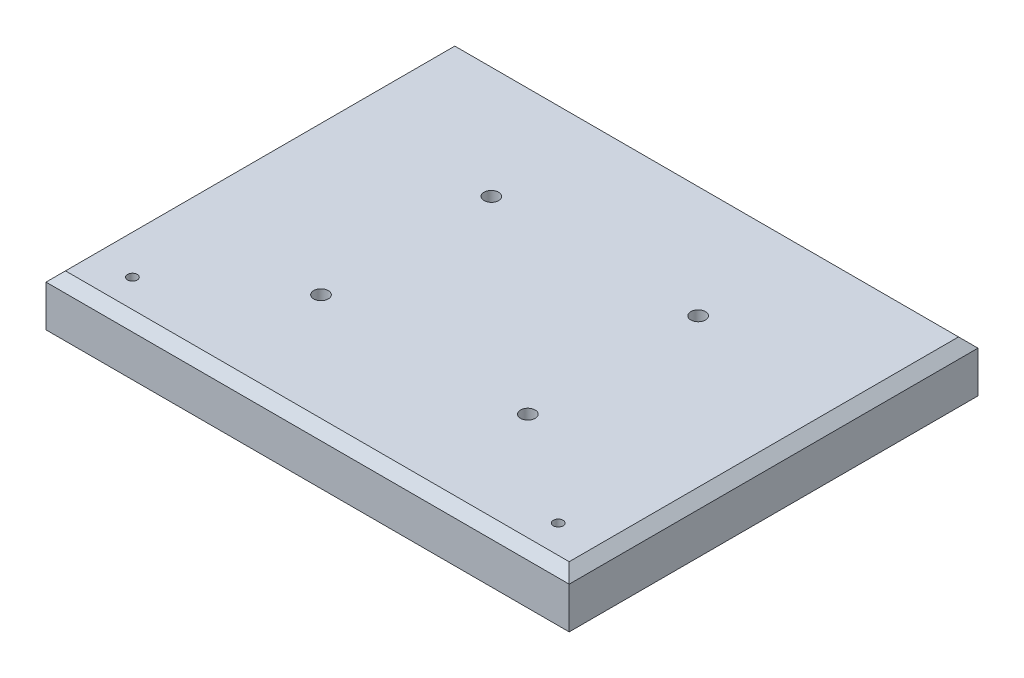
ISO-10303-21;
HEADER;
FILE_DESCRIPTION(('STEP AP214'),'2;1');
FILE_NAME('part.step','',(''),(''),'','','');
FILE_SCHEMA(('AUTOMOTIVE_DESIGN { 1 0 10303 214 1 1 1 1 }'));
ENDSEC;
DATA;
#1=APPLICATION_CONTEXT('core data for automotive mechanical design processes');
#2=APPLICATION_PROTOCOL_DEFINITION('international standard','automotive_design',2000,#1);
#3=PRODUCT_CONTEXT('',#1,'mechanical');
#4=PRODUCT('Part','Part','',(#3));
#5=PRODUCT_RELATED_PRODUCT_CATEGORY('part','',(#4));
#6=PRODUCT_DEFINITION_FORMATION('','',#4);
#7=PRODUCT_DEFINITION_CONTEXT('part definition',#1,'design');
#8=PRODUCT_DEFINITION('design','',#6,#7);
#9=PRODUCT_DEFINITION_SHAPE('','',#8);
#10=(LENGTH_UNIT() NAMED_UNIT(*) SI_UNIT(.MILLI.,.METRE.));
#11=(NAMED_UNIT(*) PLANE_ANGLE_UNIT() SI_UNIT($,.RADIAN.));
#12=(NAMED_UNIT(*) SI_UNIT($,.STERADIAN.) SOLID_ANGLE_UNIT());
#13=UNCERTAINTY_MEASURE_WITH_UNIT(LENGTH_MEASURE(1.E-05),#10,'distance_accuracy_value','');
#14=(GEOMETRIC_REPRESENTATION_CONTEXT(3) GLOBAL_UNCERTAINTY_ASSIGNED_CONTEXT((#13)) GLOBAL_UNIT_ASSIGNED_CONTEXT((#10,
#11,#12)) REPRESENTATION_CONTEXT('',''));
#15=CARTESIAN_POINT('',(0.,0.,0.));
#16=DIRECTION('',(0.,0.,1.));
#17=DIRECTION('',(1.,0.,0.));
#18=AXIS2_PLACEMENT_3D('',#15,#16,#17);
#19=CARTESIAN_POINT('',(195.,21.,-15.5));
#20=DIRECTION('',(0.,-1.,0.));
#21=DIRECTION('',(0.,0.,-1.));
#22=AXIS2_PLACEMENT_3D('',#19,#20,#21);
#23=CYLINDRICAL_SURFACE('',#22,2.);
#24=CARTESIAN_POINT('',(195.,21.,-15.5));
#25=DIRECTION('',(0.,1.,0.));
#26=DIRECTION('',(0.,0.,1.));
#27=AXIS2_PLACEMENT_3D('',#24,#25,#26);
#28=CIRCLE('',#27,2.);
#29=CARTESIAN_POINT('',(195.,21.,-13.5));
#30=VERTEX_POINT('',#29);
#31=EDGE_CURVE('E258',#30,#30,#28,.T.);
#32=ORIENTED_EDGE('',*,*,#31,.T.);
#33=EDGE_LOOP('',(#32));
#34=FACE_BOUND('',#33,.T.);
#35=CARTESIAN_POINT('',(195.,6.5,-15.5));
#36=DIRECTION('',(0.,-1.,0.));
#37=DIRECTION('',(0.,0.,-1.));
#38=AXIS2_PLACEMENT_3D('',#35,#36,#37);
#39=CIRCLE('',#38,2.);
#40=CARTESIAN_POINT('',(195.,6.5,-17.5));
#41=VERTEX_POINT('',#40);
#42=EDGE_CURVE('E52',#41,#41,#39,.T.);
#43=ORIENTED_EDGE('',*,*,#42,.T.);
#44=EDGE_LOOP('',(#43));
#45=FACE_BOUND('',#44,.T.);
#46=ADVANCED_FACE('F47',(#34,#45),#23,.F.);
#47=CARTESIAN_POINT('',(20.,21.,-15.5));
#48=DIRECTION('',(0.,-1.,0.));
#49=DIRECTION('',(0.,0.,-1.));
#50=AXIS2_PLACEMENT_3D('',#47,#48,#49);
#51=CYLINDRICAL_SURFACE('',#50,2.);
#52=CARTESIAN_POINT('',(20.,21.,-15.5));
#53=DIRECTION('',(0.,1.,0.));
#54=DIRECTION('',(0.,0.,1.));
#55=AXIS2_PLACEMENT_3D('',#52,#53,#54);
#56=CIRCLE('',#55,2.);
#57=CARTESIAN_POINT('',(20.,21.,-13.5));
#58=VERTEX_POINT('',#57);
#59=EDGE_CURVE('E182',#58,#58,#56,.T.);
#60=ORIENTED_EDGE('',*,*,#59,.T.);
#61=EDGE_LOOP('',(#60));
#62=FACE_BOUND('',#61,.T.);
#63=CARTESIAN_POINT('',(20.,6.5,-15.5));
#64=DIRECTION('',(0.,-1.,0.));
#65=DIRECTION('',(0.,0.,-1.));
#66=AXIS2_PLACEMENT_3D('',#63,#64,#65);
#67=CIRCLE('',#66,2.);
#68=CARTESIAN_POINT('',(20.,6.5,-17.5));
#69=VERTEX_POINT('',#68);
#70=EDGE_CURVE('E198',#69,#69,#67,.T.);
#71=ORIENTED_EDGE('',*,*,#70,.T.);
#72=EDGE_LOOP('',(#71));
#73=FACE_BOUND('',#72,.T.);
#74=ADVANCED_FACE('F290',(#62,#73),#51,.F.);
#75=CARTESIAN_POINT('',(150.,21.,-118.));
#76=DIRECTION('',(0.,-1.,0.));
#77=DIRECTION('',(0.,0.,-1.));
#78=AXIS2_PLACEMENT_3D('',#75,#76,#77);
#79=CYLINDRICAL_SURFACE('',#78,2.99999999999999);
#80=CARTESIAN_POINT('',(150.,21.,-118.));
#81=DIRECTION('',(0.,1.,0.));
#82=DIRECTION('',(0.,0.,1.));
#83=AXIS2_PLACEMENT_3D('',#80,#81,#82);
#84=CIRCLE('',#83,2.99999999999999);
#85=CARTESIAN_POINT('',(150.,21.,-115.));
#86=VERTEX_POINT('',#85);
#87=EDGE_CURVE('E126',#86,#86,#84,.T.);
#88=ORIENTED_EDGE('',*,*,#87,.T.);
#89=EDGE_LOOP('',(#88));
#90=FACE_BOUND('',#89,.T.);
#91=CARTESIAN_POINT('',(150.,13.,-118.));
#92=DIRECTION('',(0.,-1.,0.));
#93=DIRECTION('',(0.,0.,-1.));
#94=AXIS2_PLACEMENT_3D('',#91,#92,#93);
#95=CIRCLE('',#94,2.99999999999999);
#96=CARTESIAN_POINT('',(150.,13.,-121.));
#97=VERTEX_POINT('',#96);
#98=EDGE_CURVE('E171',#97,#97,#95,.T.);
#99=ORIENTED_EDGE('',*,*,#98,.T.);
#100=EDGE_LOOP('',(#99));
#101=FACE_BOUND('',#100,.T.);
#102=ADVANCED_FACE('F292',(#90,#101),#79,.F.);
#103=CARTESIAN_POINT('',(65.,21.,-118.));
#104=DIRECTION('',(0.,-1.,0.));
#105=DIRECTION('',(0.,0.,-1.));
#106=AXIS2_PLACEMENT_3D('',#103,#104,#105);
#107=CYLINDRICAL_SURFACE('',#106,3.00000000000001);
#108=CARTESIAN_POINT('',(65.,21.,-118.));
#109=DIRECTION('',(0.,1.,0.));
#110=DIRECTION('',(0.,0.,1.));
#111=AXIS2_PLACEMENT_3D('',#108,#109,#110);
#112=CIRCLE('',#111,3.00000000000001);
#113=CARTESIAN_POINT('',(65.,21.,-115.));
#114=VERTEX_POINT('',#113);
#115=EDGE_CURVE('E130',#114,#114,#112,.T.);
#116=ORIENTED_EDGE('',*,*,#115,.T.);
#117=EDGE_LOOP('',(#116));
#118=FACE_BOUND('',#117,.T.);
#119=CARTESIAN_POINT('',(65.,13.,-118.));
#120=DIRECTION('',(0.,-1.,0.));
#121=DIRECTION('',(0.,0.,-1.));
#122=AXIS2_PLACEMENT_3D('',#119,#120,#121);
#123=CIRCLE('',#122,3.00000000000001);
#124=CARTESIAN_POINT('',(65.,13.,-121.));
#125=VERTEX_POINT('',#124);
#126=EDGE_CURVE('E192',#125,#125,#123,.T.);
#127=ORIENTED_EDGE('',*,*,#126,.T.);
#128=EDGE_LOOP('',(#127));
#129=FACE_BOUND('',#128,.T.);
#130=ADVANCED_FACE('F273',(#118,#129),#107,.F.);
#131=CARTESIAN_POINT('',(65.,21.,-48.));
#132=DIRECTION('',(0.,-1.,0.));
#133=DIRECTION('',(0.,0.,-1.));
#134=AXIS2_PLACEMENT_3D('',#131,#132,#133);
#135=CYLINDRICAL_SURFACE('',#134,3.00000000000001);
#136=CARTESIAN_POINT('',(65.,21.,-48.));
#137=DIRECTION('',(0.,1.,0.));
#138=DIRECTION('',(0.,0.,1.));
#139=AXIS2_PLACEMENT_3D('',#136,#137,#138);
#140=CIRCLE('',#139,3.00000000000001);
#141=CARTESIAN_POINT('',(65.,21.,-45.));
#142=VERTEX_POINT('',#141);
#143=EDGE_CURVE('E266',#142,#142,#140,.T.);
#144=ORIENTED_EDGE('',*,*,#143,.T.);
#145=EDGE_LOOP('',(#144));
#146=FACE_BOUND('',#145,.T.);
#147=CARTESIAN_POINT('',(65.,13.,-48.));
#148=DIRECTION('',(0.,-1.,0.));
#149=DIRECTION('',(0.,0.,-1.));
#150=AXIS2_PLACEMENT_3D('',#147,#148,#149);
#151=CIRCLE('',#150,3.00000000000001);
#152=CARTESIAN_POINT('',(65.,13.,-51.));
#153=VERTEX_POINT('',#152);
#154=EDGE_CURVE('E187',#153,#153,#151,.T.);
#155=ORIENTED_EDGE('',*,*,#154,.T.);
#156=EDGE_LOOP('',(#155));
#157=FACE_BOUND('',#156,.T.);
#158=ADVANCED_FACE('F309',(#146,#157),#135,.F.);
#159=CARTESIAN_POINT('',(150.,21.,-48.));
#160=DIRECTION('',(0.,-1.,0.));
#161=DIRECTION('',(0.,0.,-1.));
#162=AXIS2_PLACEMENT_3D('',#159,#160,#161);
#163=CYLINDRICAL_SURFACE('',#162,2.99999999999999);
#164=CARTESIAN_POINT('',(150.,21.,-48.));
#165=DIRECTION('',(0.,1.,0.));
#166=DIRECTION('',(0.,0.,1.));
#167=AXIS2_PLACEMENT_3D('',#164,#165,#166);
#168=CIRCLE('',#167,2.99999999999999);
#169=CARTESIAN_POINT('',(150.,21.,-45.));
#170=VERTEX_POINT('',#169);
#171=EDGE_CURVE('E262',#170,#170,#168,.T.);
#172=ORIENTED_EDGE('',*,*,#171,.T.);
#173=EDGE_LOOP('',(#172));
#174=FACE_BOUND('',#173,.T.);
#175=CARTESIAN_POINT('',(150.,13.,-48.));
#176=DIRECTION('',(0.,-1.,0.));
#177=DIRECTION('',(0.,0.,-1.));
#178=AXIS2_PLACEMENT_3D('',#175,#176,#177);
#179=CIRCLE('',#178,2.99999999999999);
#180=CARTESIAN_POINT('',(150.,13.,-51.));
#181=VERTEX_POINT('',#180);
#182=EDGE_CURVE('E183',#181,#181,#179,.T.);
#183=ORIENTED_EDGE('',*,*,#182,.T.);
#184=EDGE_LOOP('',(#183));
#185=FACE_BOUND('',#184,.T.);
#186=ADVANCED_FACE('F279',(#174,#185),#163,.F.);
#187=CARTESIAN_POINT('',(0.,21.,0.));
#188=DIRECTION('',(0.,-1.,0.));
#189=DIRECTION('',(0.,0.,-1.));
#190=AXIS2_PLACEMENT_3D('',#187,#188,#189);
#191=PLANE('',#190);
#192=DIRECTION('',(0.,0.,-1.));
#193=VECTOR('',#192,1.);
#194=CARTESIAN_POINT('',(211.,21.,0.));
#195=LINE('',#194,#193);
#196=CARTESIAN_POINT('',(211.,21.,-4.));
#197=VERTEX_POINT('',#196);
#198=CARTESIAN_POINT('',(211.,21.,-164.));
#199=VERTEX_POINT('',#198);
#200=EDGE_CURVE('E109',#197,#199,#195,.T.);
#201=ORIENTED_EDGE('',*,*,#200,.T.);
#202=DIRECTION('',(-1.,0.,0.));
#203=VECTOR('',#202,1.);
#204=CARTESIAN_POINT('',(0.,21.,-164.));
#205=LINE('',#204,#203);
#206=CARTESIAN_POINT('',(4.,21.,-164.));
#207=VERTEX_POINT('',#206);
#208=EDGE_CURVE('E154',#199,#207,#205,.T.);
#209=ORIENTED_EDGE('',*,*,#208,.T.);
#210=DIRECTION('',(0.,0.,1.));
#211=VECTOR('',#210,1.);
#212=CARTESIAN_POINT('',(4.,21.,0.));
#213=LINE('',#212,#211);
#214=CARTESIAN_POINT('',(4.,21.,-4.));
#215=VERTEX_POINT('',#214);
#216=EDGE_CURVE('E151',#207,#215,#213,.T.);
#217=ORIENTED_EDGE('',*,*,#216,.T.);
#218=DIRECTION('',(1.,0.,0.));
#219=VECTOR('',#218,1.);
#220=CARTESIAN_POINT('',(0.,21.,-4.));
#221=LINE('',#220,#219);
#222=EDGE_CURVE('E148',#215,#197,#221,.T.);
#223=ORIENTED_EDGE('',*,*,#222,.T.);
#224=EDGE_LOOP('',(#201,#209,#217,#223));
#225=FACE_BOUND('',#224,.T.);
#226=ORIENTED_EDGE('',*,*,#87,.F.);
#227=EDGE_LOOP('',(#226));
#228=FACE_BOUND('',#227,.T.);
#229=ORIENTED_EDGE('',*,*,#115,.F.);
#230=EDGE_LOOP('',(#229));
#231=FACE_BOUND('',#230,.T.);
#232=ORIENTED_EDGE('',*,*,#143,.F.);
#233=EDGE_LOOP('',(#232));
#234=FACE_BOUND('',#233,.T.);
#235=ORIENTED_EDGE('',*,*,#171,.F.);
#236=EDGE_LOOP('',(#235));
#237=FACE_BOUND('',#236,.T.);
#238=ORIENTED_EDGE('',*,*,#31,.F.);
#239=EDGE_LOOP('',(#238));
#240=FACE_BOUND('',#239,.T.);
#241=ORIENTED_EDGE('',*,*,#59,.F.);
#242=EDGE_LOOP('',(#241));
#243=FACE_BOUND('',#242,.T.);
#244=ADVANCED_FACE('F276',(#225,#228,#231,#234,#237,#240,#243),#191,.F.);
#245=CARTESIAN_POINT('',(0.,0.,0.));
#246=DIRECTION('',(0.,-1.,0.));
#247=DIRECTION('',(0.,0.,-1.));
#248=AXIS2_PLACEMENT_3D('',#245,#246,#247);
#249=PLANE('',#248);
#250=CARTESIAN_POINT('',(20.,0.,-15.5));
#251=DIRECTION('',(0.,-1.,0.));
#252=DIRECTION('',(0.,0.,-1.));
#253=AXIS2_PLACEMENT_3D('',#250,#251,#252);
#254=CIRCLE('',#253,5.);
#255=CARTESIAN_POINT('',(20.,0.,-20.5));
#256=VERTEX_POINT('',#255);
#257=EDGE_CURVE('E209',#256,#256,#254,.T.);
#258=ORIENTED_EDGE('',*,*,#257,.F.);
#259=EDGE_LOOP('',(#258));
#260=FACE_BOUND('',#259,.T.);
#261=CARTESIAN_POINT('',(195.,0.,-15.5));
#262=DIRECTION('',(0.,-1.,0.));
#263=DIRECTION('',(0.,0.,-1.));
#264=AXIS2_PLACEMENT_3D('',#261,#262,#263);
#265=CIRCLE('',#264,5.00000000000002);
#266=CARTESIAN_POINT('',(195.,0.,-20.5));
#267=VERTEX_POINT('',#266);
#268=EDGE_CURVE('E215',#267,#267,#265,.T.);
#269=ORIENTED_EDGE('',*,*,#268,.F.);
#270=EDGE_LOOP('',(#269));
#271=FACE_BOUND('',#270,.T.);
#272=CARTESIAN_POINT('',(150.,0.,-48.));
#273=DIRECTION('',(0.,-1.,0.));
#274=DIRECTION('',(0.,0.,-1.));
#275=AXIS2_PLACEMENT_3D('',#272,#273,#274);
#276=CIRCLE('',#275,9.50000000000001);
#277=CARTESIAN_POINT('',(150.,0.,-57.5));
#278=VERTEX_POINT('',#277);
#279=EDGE_CURVE('E233',#278,#278,#276,.T.);
#280=ORIENTED_EDGE('',*,*,#279,.F.);
#281=EDGE_LOOP('',(#280));
#282=FACE_BOUND('',#281,.T.);
#283=CARTESIAN_POINT('',(65.,0.,-118.));
#284=DIRECTION('',(0.,-1.,0.));
#285=DIRECTION('',(0.,0.,-1.));
#286=AXIS2_PLACEMENT_3D('',#283,#284,#285);
#287=CIRCLE('',#286,9.49999999999999);
#288=CARTESIAN_POINT('',(65.,0.,-127.5));
#289=VERTEX_POINT('',#288);
#290=EDGE_CURVE('E242',#289,#289,#287,.T.);
#291=ORIENTED_EDGE('',*,*,#290,.F.);
#292=EDGE_LOOP('',(#291));
#293=FACE_BOUND('',#292,.T.);
#294=CARTESIAN_POINT('',(150.,0.,-118.));
#295=DIRECTION('',(0.,-1.,0.));
#296=DIRECTION('',(0.,0.,-1.));
#297=AXIS2_PLACEMENT_3D('',#294,#295,#296);
#298=CIRCLE('',#297,9.50000000000001);
#299=CARTESIAN_POINT('',(150.,0.,-127.5));
#300=VERTEX_POINT('',#299);
#301=EDGE_CURVE('E225',#300,#300,#298,.T.);
#302=ORIENTED_EDGE('',*,*,#301,.F.);
#303=EDGE_LOOP('',(#302));
#304=FACE_BOUND('',#303,.T.);
#305=CARTESIAN_POINT('',(65.,0.,-48.));
#306=DIRECTION('',(0.,-1.,0.));
#307=DIRECTION('',(0.,0.,-1.));
#308=AXIS2_PLACEMENT_3D('',#305,#306,#307);
#309=CIRCLE('',#308,9.5);
#310=CARTESIAN_POINT('',(65.,0.,-57.5));
#311=VERTEX_POINT('',#310);
#312=EDGE_CURVE('E237',#311,#311,#309,.T.);
#313=ORIENTED_EDGE('',*,*,#312,.F.);
#314=EDGE_LOOP('',(#313));
#315=FACE_BOUND('',#314,.T.);
#316=DIRECTION('',(0.,0.,1.));
#317=VECTOR('',#316,1.);
#318=CARTESIAN_POINT('',(0.,0.,0.));
#319=LINE('',#318,#317);
#320=CARTESIAN_POINT('',(0.,0.,-168.));
#321=VERTEX_POINT('',#320);
#322=CARTESIAN_POINT('',(0.,0.,0.));
#323=VERTEX_POINT('',#322);
#324=EDGE_CURVE('E116',#321,#323,#319,.T.);
#325=ORIENTED_EDGE('',*,*,#324,.F.);
#326=DIRECTION('',(-1.,0.,0.));
#327=VECTOR('',#326,1.);
#328=CARTESIAN_POINT('',(0.,0.,-168.));
#329=LINE('',#328,#327);
#330=CARTESIAN_POINT('',(215.,0.,-168.));
#331=VERTEX_POINT('',#330);
#332=EDGE_CURVE('E136',#331,#321,#329,.T.);
#333=ORIENTED_EDGE('',*,*,#332,.F.);
#334=DIRECTION('',(0.,0.,-1.));
#335=VECTOR('',#334,1.);
#336=CARTESIAN_POINT('',(215.,0.,0.));
#337=LINE('',#336,#335);
#338=CARTESIAN_POINT('',(215.,0.,0.));
#339=VERTEX_POINT('',#338);
#340=EDGE_CURVE('E118',#339,#331,#337,.T.);
#341=ORIENTED_EDGE('',*,*,#340,.F.);
#342=DIRECTION('',(1.,0.,0.));
#343=VECTOR('',#342,1.);
#344=CARTESIAN_POINT('',(0.,0.,0.));
#345=LINE('',#344,#343);
#346=EDGE_CURVE('E103',#323,#339,#345,.T.);
#347=ORIENTED_EDGE('',*,*,#346,.F.);
#348=EDGE_LOOP('',(#325,#333,#341,#347));
#349=FACE_BOUND('',#348,.T.);
#350=ADVANCED_FACE('F114',(#260,#271,#282,#293,#304,#315,#349),#249,.T.);
#351=CARTESIAN_POINT('',(0.,21.,0.));
#352=DIRECTION('',(1.,0.,0.));
#353=DIRECTION('',(0.,0.,-1.));
#354=AXIS2_PLACEMENT_3D('',#351,#352,#353);
#355=PLANE('',#354);
#356=DIRECTION('',(0.,-1.,0.));
#357=VECTOR('',#356,1.);
#358=CARTESIAN_POINT('',(0.,21.,0.));
#359=LINE('',#358,#357);
#360=CARTESIAN_POINT('',(0.,17.,0.));
#361=VERTEX_POINT('',#360);
#362=EDGE_CURVE('E100',#361,#323,#359,.T.);
#363=ORIENTED_EDGE('',*,*,#362,.F.);
#364=DIRECTION('',(0.,0.,-1.));
#365=VECTOR('',#364,1.);
#366=CARTESIAN_POINT('',(0.,17.,0.));
#367=LINE('',#366,#365);
#368=CARTESIAN_POINT('',(0.,17.,-168.));
#369=VERTEX_POINT('',#368);
#370=EDGE_CURVE('E162',#361,#369,#367,.T.);
#371=ORIENTED_EDGE('',*,*,#370,.T.);
#372=DIRECTION('',(0.,-1.,0.));
#373=VECTOR('',#372,1.);
#374=CARTESIAN_POINT('',(0.,21.,-168.));
#375=LINE('',#374,#373);
#376=EDGE_CURVE('E123',#369,#321,#375,.T.);
#377=ORIENTED_EDGE('',*,*,#376,.T.);
#378=ORIENTED_EDGE('',*,*,#324,.T.);
#379=EDGE_LOOP('',(#363,#371,#377,#378));
#380=FACE_BOUND('',#379,.T.);
#381=ADVANCED_FACE('F121',(#380),#355,.F.);
#382=CARTESIAN_POINT('',(0.,21.,0.));
#383=DIRECTION('',(0.,0.,-1.));
#384=DIRECTION('',(-1.,0.,0.));
#385=AXIS2_PLACEMENT_3D('',#382,#383,#384);
#386=PLANE('',#385);
#387=DIRECTION('',(0.,-1.,0.));
#388=VECTOR('',#387,1.);
#389=CARTESIAN_POINT('',(215.,21.,0.));
#390=LINE('',#389,#388);
#391=CARTESIAN_POINT('',(215.,17.,0.));
#392=VERTEX_POINT('',#391);
#393=EDGE_CURVE('E110',#392,#339,#390,.T.);
#394=ORIENTED_EDGE('',*,*,#393,.F.);
#395=DIRECTION('',(-1.,0.,0.));
#396=VECTOR('',#395,1.);
#397=CARTESIAN_POINT('',(0.,17.,0.));
#398=LINE('',#397,#396);
#399=EDGE_CURVE('E58',#392,#361,#398,.T.);
#400=ORIENTED_EDGE('',*,*,#399,.T.);
#401=ORIENTED_EDGE('',*,*,#362,.T.);
#402=ORIENTED_EDGE('',*,*,#346,.T.);
#403=EDGE_LOOP('',(#394,#400,#401,#402));
#404=FACE_BOUND('',#403,.T.);
#405=ADVANCED_FACE('F102',(#404),#386,.F.);
#406=CARTESIAN_POINT('',(215.,21.,0.));
#407=DIRECTION('',(-1.,0.,0.));
#408=DIRECTION('',(0.,0.,1.));
#409=AXIS2_PLACEMENT_3D('',#406,#407,#408);
#410=PLANE('',#409);
#411=DIRECTION('',(0.,-1.,0.));
#412=VECTOR('',#411,1.);
#413=CARTESIAN_POINT('',(215.,21.,-168.));
#414=LINE('',#413,#412);
#415=CARTESIAN_POINT('',(215.,17.,-168.));
#416=VERTEX_POINT('',#415);
#417=EDGE_CURVE('E141',#416,#331,#414,.T.);
#418=ORIENTED_EDGE('',*,*,#417,.F.);
#419=DIRECTION('',(0.,0.,1.));
#420=VECTOR('',#419,1.);
#421=CARTESIAN_POINT('',(215.,17.,0.));
#422=LINE('',#421,#420);
#423=EDGE_CURVE('E11',#416,#392,#422,.T.);
#424=ORIENTED_EDGE('',*,*,#423,.T.);
#425=ORIENTED_EDGE('',*,*,#393,.T.);
#426=ORIENTED_EDGE('',*,*,#340,.T.);
#427=EDGE_LOOP('',(#418,#424,#425,#426));
#428=FACE_BOUND('',#427,.T.);
#429=ADVANCED_FACE('F321',(#428),#410,.F.);
#430=CARTESIAN_POINT('',(0.,21.,-168.));
#431=DIRECTION('',(0.,0.,1.));
#432=DIRECTION('',(1.,0.,0.));
#433=AXIS2_PLACEMENT_3D('',#430,#431,#432);
#434=PLANE('',#433);
#435=ORIENTED_EDGE('',*,*,#376,.F.);
#436=DIRECTION('',(1.,0.,0.));
#437=VECTOR('',#436,1.);
#438=CARTESIAN_POINT('',(0.,17.,-168.));
#439=LINE('',#438,#437);
#440=EDGE_CURVE('E158',#369,#416,#439,.T.);
#441=ORIENTED_EDGE('',*,*,#440,.T.);
#442=ORIENTED_EDGE('',*,*,#417,.T.);
#443=ORIENTED_EDGE('',*,*,#332,.T.);
#444=EDGE_LOOP('',(#435,#441,#442,#443));
#445=FACE_BOUND('',#444,.T.);
#446=ADVANCED_FACE('F318',(#445),#434,.F.);
#447=CARTESIAN_POINT('',(0.,21.,-4.));
#448=DIRECTION('',(0.,-0.707106781186545,-0.70710678118655));
#449=DIRECTION('',(1.,0.,0.));
#450=AXIS2_PLACEMENT_3D('',#447,#448,#449);
#451=PLANE('',#450);
#452=DIRECTION('',(-0.577350269189624,-0.577350269189628,0.577350269189624));
#453=VECTOR('',#452,1.);
#454=CARTESIAN_POINT('',(2.66666666666668,19.6666666666667,-2.66666666666667));
#455=LINE('',#454,#453);
#456=EDGE_CURVE('E174',#361,#215,#455,.F.);
#457=ORIENTED_EDGE('',*,*,#456,.F.);
#458=ORIENTED_EDGE('',*,*,#399,.F.);
#459=DIRECTION('',(0.577350269189624,-0.577350269189628,0.577350269189624));
#460=VECTOR('',#459,1.);
#461=CARTESIAN_POINT('',(212.333333333333,19.6666666666667,-2.66666666666668));
#462=LINE('',#461,#460);
#463=EDGE_CURVE('E178',#197,#392,#462,.T.);
#464=ORIENTED_EDGE('',*,*,#463,.F.);
#465=ORIENTED_EDGE('',*,*,#222,.F.);
#466=EDGE_LOOP('',(#457,#458,#464,#465));
#467=FACE_BOUND('',#466,.T.);
#468=ADVANCED_FACE('F50',(#467),#451,.F.);
#469=CARTESIAN_POINT('',(211.,21.,0.));
#470=DIRECTION('',(-0.70710678118655,-0.707106781186545,0.));
#471=DIRECTION('',(0.,0.,-1.));
#472=AXIS2_PLACEMENT_3D('',#469,#470,#471);
#473=PLANE('',#472);
#474=ORIENTED_EDGE('',*,*,#463,.T.);
#475=ORIENTED_EDGE('',*,*,#423,.F.);
#476=DIRECTION('',(-0.577350269189624,0.577350269189628,0.577350269189624));
#477=VECTOR('',#476,1.);
#478=CARTESIAN_POINT('',(156.333333333334,75.6666666666668,-109.333333333334));
#479=LINE('',#478,#477);
#480=EDGE_CURVE('E170',#199,#416,#479,.F.);
#481=ORIENTED_EDGE('',*,*,#480,.F.);
#482=ORIENTED_EDGE('',*,*,#200,.F.);
#483=EDGE_LOOP('',(#474,#475,#481,#482));
#484=FACE_BOUND('',#483,.T.);
#485=ADVANCED_FACE('F343',(#484),#473,.F.);
#486=CARTESIAN_POINT('',(4.,21.,0.));
#487=DIRECTION('',(0.70710678118655,-0.707106781186545,0.));
#488=DIRECTION('',(0.,0.,1.));
#489=AXIS2_PLACEMENT_3D('',#486,#487,#488);
#490=PLANE('',#489);
#491=ORIENTED_EDGE('',*,*,#456,.T.);
#492=ORIENTED_EDGE('',*,*,#216,.F.);
#493=DIRECTION('',(-0.577350269189624,-0.577350269189628,-0.577350269189624));
#494=VECTOR('',#493,1.);
#495=CARTESIAN_POINT('',(58.6666666666664,75.6666666666668,-109.333333333334));
#496=LINE('',#495,#494);
#497=EDGE_CURVE('E167',#369,#207,#496,.F.);
#498=ORIENTED_EDGE('',*,*,#497,.F.);
#499=ORIENTED_EDGE('',*,*,#370,.F.);
#500=EDGE_LOOP('',(#491,#492,#498,#499));
#501=FACE_BOUND('',#500,.T.);
#502=ADVANCED_FACE('F337',(#501),#490,.F.);
#503=CARTESIAN_POINT('',(0.,21.,-164.));
#504=DIRECTION('',(0.,-0.707106781186545,0.70710678118655));
#505=DIRECTION('',(-1.,0.,0.));
#506=AXIS2_PLACEMENT_3D('',#503,#504,#505);
#507=PLANE('',#506);
#508=ORIENTED_EDGE('',*,*,#480,.T.);
#509=ORIENTED_EDGE('',*,*,#440,.F.);
#510=ORIENTED_EDGE('',*,*,#497,.T.);
#511=ORIENTED_EDGE('',*,*,#208,.F.);
#512=EDGE_LOOP('',(#508,#509,#510,#511));
#513=FACE_BOUND('',#512,.T.);
#514=ADVANCED_FACE('F330',(#513),#507,.F.);
#515=CARTESIAN_POINT('',(150.,13.,-48.));
#516=DIRECTION('',(0.,-1.,0.));
#517=DIRECTION('',(0.,0.,-1.));
#518=AXIS2_PLACEMENT_3D('',#515,#516,#517);
#519=CYLINDRICAL_SURFACE('',#518,9.50000000000001);
#520=CARTESIAN_POINT('',(150.,13.,-48.));
#521=DIRECTION('',(0.,-1.,0.));
#522=DIRECTION('',(0.,0.,-1.));
#523=AXIS2_PLACEMENT_3D('',#520,#521,#522);
#524=CIRCLE('',#523,9.50000000000001);
#525=CARTESIAN_POINT('',(150.,13.,-57.5));
#526=VERTEX_POINT('',#525);
#527=EDGE_CURVE('E238',#526,#526,#524,.T.);
#528=ORIENTED_EDGE('',*,*,#527,.F.);
#529=EDGE_LOOP('',(#528));
#530=FACE_BOUND('',#529,.T.);
#531=ORIENTED_EDGE('',*,*,#279,.T.);
#532=EDGE_LOOP('',(#531));
#533=FACE_BOUND('',#532,.T.);
#534=ADVANCED_FACE('F336',(#530,#533),#519,.F.);
#535=CARTESIAN_POINT('',(150.,13.,-48.));
#536=DIRECTION('',(0.,-1.,0.));
#537=DIRECTION('',(0.,0.,-1.));
#538=AXIS2_PLACEMENT_3D('',#535,#536,#537);
#539=PLANE('',#538);
#540=ORIENTED_EDGE('',*,*,#182,.F.);
#541=EDGE_LOOP('',(#540));
#542=FACE_BOUND('',#541,.T.);
#543=ORIENTED_EDGE('',*,*,#527,.T.);
#544=EDGE_LOOP('',(#543));
#545=FACE_BOUND('',#544,.T.);
#546=ADVANCED_FACE('F386',(#542,#545),#539,.T.);
#547=CARTESIAN_POINT('',(65.,13.,-48.));
#548=DIRECTION('',(0.,-1.,0.));
#549=DIRECTION('',(0.,0.,-1.));
#550=AXIS2_PLACEMENT_3D('',#547,#548,#549);
#551=CYLINDRICAL_SURFACE('',#550,9.5);
#552=CARTESIAN_POINT('',(65.,13.,-48.));
#553=DIRECTION('',(0.,-1.,0.));
#554=DIRECTION('',(0.,0.,-1.));
#555=AXIS2_PLACEMENT_3D('',#552,#553,#554);
#556=CIRCLE('',#555,9.5);
#557=CARTESIAN_POINT('',(65.,13.,-57.5));
#558=VERTEX_POINT('',#557);
#559=EDGE_CURVE('E188',#558,#558,#556,.T.);
#560=ORIENTED_EDGE('',*,*,#559,.F.);
#561=EDGE_LOOP('',(#560));
#562=FACE_BOUND('',#561,.T.);
#563=ORIENTED_EDGE('',*,*,#312,.T.);
#564=EDGE_LOOP('',(#563));
#565=FACE_BOUND('',#564,.T.);
#566=ADVANCED_FACE('F304',(#562,#565),#551,.F.);
#567=CARTESIAN_POINT('',(65.,13.,-48.));
#568=DIRECTION('',(0.,-1.,0.));
#569=DIRECTION('',(0.,0.,-1.));
#570=AXIS2_PLACEMENT_3D('',#567,#568,#569);
#571=PLANE('',#570);
#572=ORIENTED_EDGE('',*,*,#154,.F.);
#573=EDGE_LOOP('',(#572));
#574=FACE_BOUND('',#573,.T.);
#575=ORIENTED_EDGE('',*,*,#559,.T.);
#576=EDGE_LOOP('',(#575));
#577=FACE_BOUND('',#576,.T.);
#578=ADVANCED_FACE('F385',(#574,#577),#571,.T.);
#579=CARTESIAN_POINT('',(65.,13.,-118.));
#580=DIRECTION('',(0.,-1.,0.));
#581=DIRECTION('',(0.,0.,-1.));
#582=AXIS2_PLACEMENT_3D('',#579,#580,#581);
#583=CYLINDRICAL_SURFACE('',#582,9.49999999999999);
#584=CARTESIAN_POINT('',(65.,13.,-118.));
#585=DIRECTION('',(0.,-1.,0.));
#586=DIRECTION('',(0.,0.,-1.));
#587=AXIS2_PLACEMENT_3D('',#584,#585,#586);
#588=CIRCLE('',#587,9.49999999999999);
#589=CARTESIAN_POINT('',(65.,13.,-127.5));
#590=VERTEX_POINT('',#589);
#591=EDGE_CURVE('E229',#590,#590,#588,.T.);
#592=ORIENTED_EDGE('',*,*,#591,.F.);
#593=EDGE_LOOP('',(#592));
#594=FACE_BOUND('',#593,.T.);
#595=ORIENTED_EDGE('',*,*,#290,.T.);
#596=EDGE_LOOP('',(#595));
#597=FACE_BOUND('',#596,.T.);
#598=ADVANCED_FACE('F392',(#594,#597),#583,.F.);
#599=CARTESIAN_POINT('',(65.,13.,-118.));
#600=DIRECTION('',(0.,-1.,0.));
#601=DIRECTION('',(0.,0.,-1.));
#602=AXIS2_PLACEMENT_3D('',#599,#600,#601);
#603=PLANE('',#602);
#604=ORIENTED_EDGE('',*,*,#126,.F.);
#605=EDGE_LOOP('',(#604));
#606=FACE_BOUND('',#605,.T.);
#607=ORIENTED_EDGE('',*,*,#591,.T.);
#608=EDGE_LOOP('',(#607));
#609=FACE_BOUND('',#608,.T.);
#610=ADVANCED_FACE('F377',(#606,#609),#603,.T.);
#611=CARTESIAN_POINT('',(150.,13.,-118.));
#612=DIRECTION('',(0.,-1.,0.));
#613=DIRECTION('',(0.,0.,-1.));
#614=AXIS2_PLACEMENT_3D('',#611,#612,#613);
#615=CYLINDRICAL_SURFACE('',#614,9.50000000000001);
#616=CARTESIAN_POINT('',(150.,13.,-118.));
#617=DIRECTION('',(0.,-1.,0.));
#618=DIRECTION('',(0.,0.,-1.));
#619=AXIS2_PLACEMENT_3D('',#616,#617,#618);
#620=CIRCLE('',#619,9.50000000000001);
#621=CARTESIAN_POINT('',(150.,13.,-127.5));
#622=VERTEX_POINT('',#621);
#623=EDGE_CURVE('E207',#622,#622,#620,.T.);
#624=ORIENTED_EDGE('',*,*,#623,.F.);
#625=EDGE_LOOP('',(#624));
#626=FACE_BOUND('',#625,.T.);
#627=ORIENTED_EDGE('',*,*,#301,.T.);
#628=EDGE_LOOP('',(#627));
#629=FACE_BOUND('',#628,.T.);
#630=ADVANCED_FACE('F371',(#626,#629),#615,.F.);
#631=CARTESIAN_POINT('',(150.,13.,-118.));
#632=DIRECTION('',(0.,-1.,0.));
#633=DIRECTION('',(0.,0.,-1.));
#634=AXIS2_PLACEMENT_3D('',#631,#632,#633);
#635=PLANE('',#634);
#636=ORIENTED_EDGE('',*,*,#98,.F.);
#637=EDGE_LOOP('',(#636));
#638=FACE_BOUND('',#637,.T.);
#639=ORIENTED_EDGE('',*,*,#623,.T.);
#640=EDGE_LOOP('',(#639));
#641=FACE_BOUND('',#640,.T.);
#642=ADVANCED_FACE('F367',(#638,#641),#635,.T.);
#643=CARTESIAN_POINT('',(20.,6.5,-15.5));
#644=DIRECTION('',(0.,-1.,0.));
#645=DIRECTION('',(0.,0.,-1.));
#646=AXIS2_PLACEMENT_3D('',#643,#644,#645);
#647=CYLINDRICAL_SURFACE('',#646,5.);
#648=CARTESIAN_POINT('',(20.,6.5,-15.5));
#649=DIRECTION('',(0.,-1.,0.));
#650=DIRECTION('',(0.,0.,-1.));
#651=AXIS2_PLACEMENT_3D('',#648,#649,#650);
#652=CIRCLE('',#651,5.);
#653=CARTESIAN_POINT('',(20.,6.5,-20.5));
#654=VERTEX_POINT('',#653);
#655=EDGE_CURVE('E201',#654,#654,#652,.T.);
#656=ORIENTED_EDGE('',*,*,#655,.F.);
#657=EDGE_LOOP('',(#656));
#658=FACE_BOUND('',#657,.T.);
#659=ORIENTED_EDGE('',*,*,#257,.T.);
#660=EDGE_LOOP('',(#659));
#661=FACE_BOUND('',#660,.T.);
#662=ADVANCED_FACE('F370',(#658,#661),#647,.F.);
#663=CARTESIAN_POINT('',(20.,6.5,-15.5));
#664=DIRECTION('',(0.,-1.,0.));
#665=DIRECTION('',(0.,0.,-1.));
#666=AXIS2_PLACEMENT_3D('',#663,#664,#665);
#667=PLANE('',#666);
#668=ORIENTED_EDGE('',*,*,#70,.F.);
#669=EDGE_LOOP('',(#668));
#670=FACE_BOUND('',#669,.T.);
#671=ORIENTED_EDGE('',*,*,#655,.T.);
#672=EDGE_LOOP('',(#671));
#673=FACE_BOUND('',#672,.T.);
#674=ADVANCED_FACE('F447',(#670,#673),#667,.T.);
#675=CARTESIAN_POINT('',(195.,6.5,-15.5));
#676=DIRECTION('',(0.,-1.,0.));
#677=DIRECTION('',(0.,0.,-1.));
#678=AXIS2_PLACEMENT_3D('',#675,#676,#677);
#679=CYLINDRICAL_SURFACE('',#678,5.00000000000002);
#680=CARTESIAN_POINT('',(195.,6.5,-15.5));
#681=DIRECTION('',(0.,-1.,0.));
#682=DIRECTION('',(0.,0.,-1.));
#683=AXIS2_PLACEMENT_3D('',#680,#681,#682);
#684=CIRCLE('',#683,5.00000000000002);
#685=CARTESIAN_POINT('',(195.,6.5,-20.5));
#686=VERTEX_POINT('',#685);
#687=EDGE_CURVE('E221',#686,#686,#684,.T.);
#688=ORIENTED_EDGE('',*,*,#687,.F.);
#689=EDGE_LOOP('',(#688));
#690=FACE_BOUND('',#689,.T.);
#691=ORIENTED_EDGE('',*,*,#268,.T.);
#692=EDGE_LOOP('',(#691));
#693=FACE_BOUND('',#692,.T.);
#694=ADVANCED_FACE('F456',(#690,#693),#679,.F.);
#695=CARTESIAN_POINT('',(195.,6.5,-15.5));
#696=DIRECTION('',(0.,-1.,0.));
#697=DIRECTION('',(0.,0.,-1.));
#698=AXIS2_PLACEMENT_3D('',#695,#696,#697);
#699=PLANE('',#698);
#700=ORIENTED_EDGE('',*,*,#42,.F.);
#701=EDGE_LOOP('',(#700));
#702=FACE_BOUND('',#701,.T.);
#703=ORIENTED_EDGE('',*,*,#687,.T.);
#704=EDGE_LOOP('',(#703));
#705=FACE_BOUND('',#704,.T.);
#706=ADVANCED_FACE('F465',(#702,#705),#699,.T.);
#707=CLOSED_SHELL('',(#46,#74,#102,#130,#158,#186,#244,#350,#381,#405,#429,#446,#468,#485,#502,
#514,#534,#546,#566,#578,#598,#610,#630,#642,#662,#674,#694,#706));
#708=MANIFOLD_SOLID_BREP('B2',#707);
#709=ADVANCED_BREP_SHAPE_REPRESENTATION('',(#18,#708),#14);
#710=SHAPE_DEFINITION_REPRESENTATION(#9,#709);
ENDSEC;
END-ISO-10303-21;
